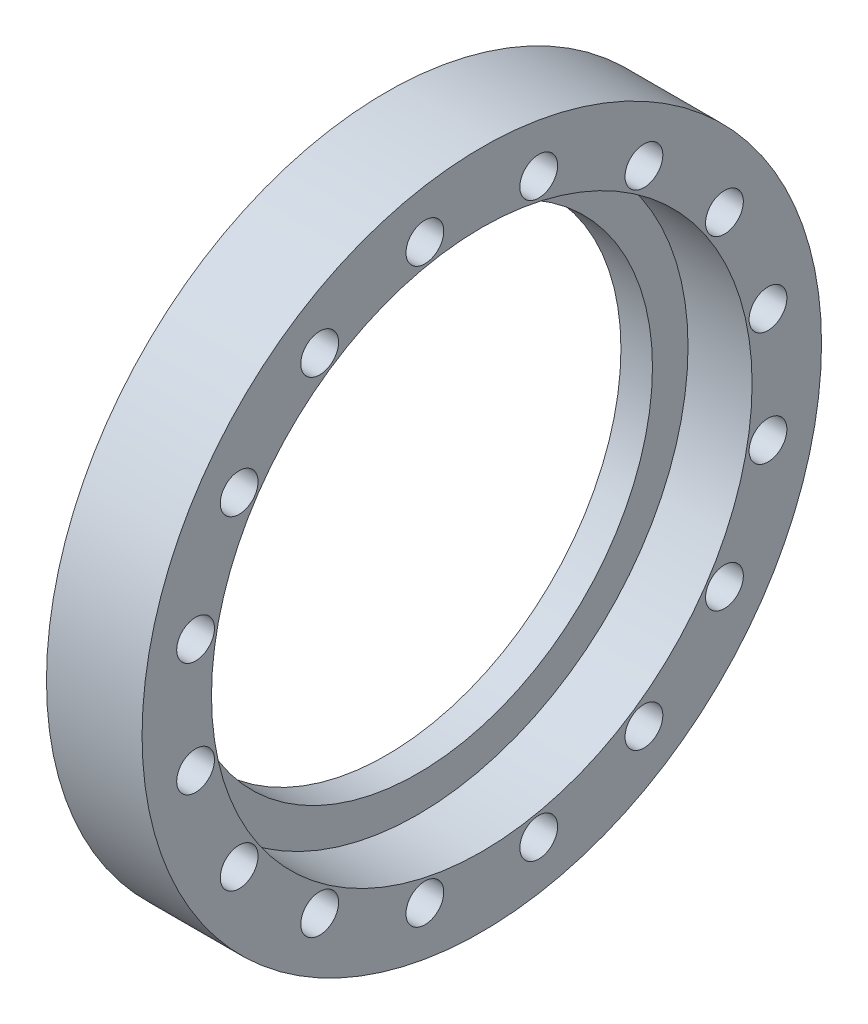
ISO-10303-21;
HEADER;
FILE_DESCRIPTION(('STEP AP214'),'2;1');
FILE_NAME('part.step','',(''),(''),'','','');
FILE_SCHEMA(('AUTOMOTIVE_DESIGN { 1 0 10303 214 1 1 1 1 }'));
ENDSEC;
DATA;
#1=APPLICATION_CONTEXT('core data for automotive mechanical design processes');
#2=APPLICATION_PROTOCOL_DEFINITION('international standard','automotive_design',2000,#1);
#3=PRODUCT_CONTEXT('',#1,'mechanical');
#4=PRODUCT('Part','Part','',(#3));
#5=PRODUCT_RELATED_PRODUCT_CATEGORY('part','',(#4));
#6=PRODUCT_DEFINITION_FORMATION('','',#4);
#7=PRODUCT_DEFINITION_CONTEXT('part definition',#1,'design');
#8=PRODUCT_DEFINITION('design','',#6,#7);
#9=PRODUCT_DEFINITION_SHAPE('','',#8);
#10=(LENGTH_UNIT() NAMED_UNIT(*) SI_UNIT(.MILLI.,.METRE.));
#11=(NAMED_UNIT(*) PLANE_ANGLE_UNIT() SI_UNIT($,.RADIAN.));
#12=(NAMED_UNIT(*) SI_UNIT($,.STERADIAN.) SOLID_ANGLE_UNIT());
#13=UNCERTAINTY_MEASURE_WITH_UNIT(LENGTH_MEASURE(1.E-05),#10,'distance_accuracy_value','');
#14=(GEOMETRIC_REPRESENTATION_CONTEXT(3) GLOBAL_UNCERTAINTY_ASSIGNED_CONTEXT((#13)) GLOBAL_UNIT_ASSIGNED_CONTEXT((#10,
#11,#12)) REPRESENTATION_CONTEXT('',''));
#15=CARTESIAN_POINT('',(0.,0.,0.));
#16=DIRECTION('',(0.,0.,1.));
#17=DIRECTION('',(1.,0.,0.));
#18=AXIS2_PLACEMENT_3D('',#15,#16,#17);
#19=CARTESIAN_POINT('',(7.03579999999964,56.35625,0.));
#20=DIRECTION('',(1.,0.,0.));
#21=DIRECTION('',(0.,0.,-1.));
#22=AXIS2_PLACEMENT_3D('',#19,#20,#21);
#23=PLANE('',#22);
#24=CARTESIAN_POINT('',(7.03579999999964,0.,0.));
#25=DIRECTION('',(1.,0.,0.));
#26=DIRECTION('',(0.,0.,-1.));
#27=AXIS2_PLACEMENT_3D('',#24,#25,#26);
#28=CIRCLE('',#27,52.3875);
#29=CARTESIAN_POINT('',(7.03579999999964,0.,-52.3875));
#30=VERTEX_POINT('',#29);
#31=EDGE_CURVE('E129',#30,#30,#28,.F.);
#32=ORIENTED_EDGE('',*,*,#31,.T.);
#33=EDGE_LOOP('',(#32));
#34=FACE_BOUND('',#33,.T.);
#35=CARTESIAN_POINT('',(7.03579999999964,0.,0.));
#36=DIRECTION('',(1.,0.,0.));
#37=DIRECTION('',(0.,0.,-1.));
#38=AXIS2_PLACEMENT_3D('',#35,#36,#37);
#39=CIRCLE('',#38,60.325);
#40=CARTESIAN_POINT('',(7.03579999999964,0.,-60.325));
#41=VERTEX_POINT('',#40);
#42=EDGE_CURVE('E17',#41,#41,#39,.T.);
#43=ORIENTED_EDGE('',*,*,#42,.T.);
#44=EDGE_LOOP('',(#43));
#45=FACE_BOUND('',#44,.T.);
#46=ADVANCED_FACE('F13',(#34,#45),#23,.T.);
#47=CARTESIAN_POINT('',(14.1858999999995,0.,0.));
#48=DIRECTION('',(1.,0.,0.));
#49=DIRECTION('',(0.,0.,-1.));
#50=AXIS2_PLACEMENT_3D('',#47,#48,#49);
#51=CYLINDRICAL_SURFACE('',#50,60.325);
#52=CARTESIAN_POINT('',(21.3359999999994,0.,0.));
#53=DIRECTION('',(1.,0.,0.));
#54=DIRECTION('',(0.,0.,-1.));
#55=AXIS2_PLACEMENT_3D('',#52,#53,#54);
#56=CIRCLE('',#55,60.325);
#57=CARTESIAN_POINT('',(21.3359999999994,0.,-60.325));
#58=VERTEX_POINT('',#57);
#59=EDGE_CURVE('E79',#58,#58,#56,.F.);
#60=ORIENTED_EDGE('',*,*,#59,.F.);
#61=EDGE_LOOP('',(#60));
#62=FACE_BOUND('',#61,.T.);
#63=ORIENTED_EDGE('',*,*,#42,.F.);
#64=EDGE_LOOP('',(#63));
#65=FACE_BOUND('',#64,.T.);
#66=ADVANCED_FACE('F137',(#62,#65),#51,.F.);
#67=CARTESIAN_POINT('',(21.3359999999994,-36.1818447675414,-54.1499573829706));
#68=DIRECTION('',(-1.,0.,0.));
#69=DIRECTION('',(0.,0.,1.));
#70=AXIS2_PLACEMENT_3D('',#67,#68,#69);
#71=CYLINDRICAL_SURFACE('',#70,4.21639999999999);
#72=CARTESIAN_POINT('',(21.3359999999994,-36.1818447675414,-54.1499573829706));
#73=DIRECTION('',(-1.,0.,0.));
#74=DIRECTION('',(0.,0.,1.));
#75=AXIS2_PLACEMENT_3D('',#72,#73,#74);
#76=CIRCLE('',#75,4.21639999999999);
#77=CARTESIAN_POINT('',(21.3359999999994,-36.1818447675414,-49.9335573829707));
#78=VERTEX_POINT('',#77);
#79=EDGE_CURVE('E127',#78,#78,#76,.T.);
#80=ORIENTED_EDGE('',*,*,#79,.F.);
#81=EDGE_LOOP('',(#80));
#82=FACE_BOUND('',#81,.T.);
#83=CARTESIAN_POINT('',(0.,-36.1818447675414,-54.1499573829706));
#84=DIRECTION('',(-1.,0.,0.));
#85=DIRECTION('',(0.,0.,1.));
#86=AXIS2_PLACEMENT_3D('',#83,#84,#85);
#87=CIRCLE('',#86,4.21639999999999);
#88=CARTESIAN_POINT('',(0.,-36.1818447675414,-49.9335573829707));
#89=VERTEX_POINT('',#88);
#90=EDGE_CURVE('E76',#89,#89,#87,.F.);
#91=ORIENTED_EDGE('',*,*,#90,.F.);
#92=EDGE_LOOP('',(#91));
#93=FACE_BOUND('',#92,.T.);
#94=ADVANCED_FACE('F139',(#82,#93),#71,.F.);
#95=CARTESIAN_POINT('',(21.3359999999994,-54.1499573829707,-36.1818447675415));
#96=DIRECTION('',(-1.,0.,0.));
#97=DIRECTION('',(0.,0.,1.));
#98=AXIS2_PLACEMENT_3D('',#95,#96,#97);
#99=CYLINDRICAL_SURFACE('',#98,4.21640000000001);
#100=CARTESIAN_POINT('',(21.3359999999994,-54.1499573829707,-36.1818447675415));
#101=DIRECTION('',(-1.,0.,0.));
#102=DIRECTION('',(0.,0.,1.));
#103=AXIS2_PLACEMENT_3D('',#100,#101,#102);
#104=CIRCLE('',#103,4.21640000000001);
#105=CARTESIAN_POINT('',(21.3359999999994,-54.1499573829707,-31.9654447675414));
#106=VERTEX_POINT('',#105);
#107=EDGE_CURVE('E124',#106,#106,#104,.T.);
#108=ORIENTED_EDGE('',*,*,#107,.F.);
#109=EDGE_LOOP('',(#108));
#110=FACE_BOUND('',#109,.T.);
#111=CARTESIAN_POINT('',(0.,-54.1499573829707,-36.1818447675415));
#112=DIRECTION('',(-1.,0.,0.));
#113=DIRECTION('',(0.,0.,1.));
#114=AXIS2_PLACEMENT_3D('',#111,#112,#113);
#115=CIRCLE('',#114,4.21640000000001);
#116=CARTESIAN_POINT('',(0.,-54.1499573829707,-31.9654447675414));
#117=VERTEX_POINT('',#116);
#118=EDGE_CURVE('E73',#117,#117,#115,.F.);
#119=ORIENTED_EDGE('',*,*,#118,.F.);
#120=EDGE_LOOP('',(#119));
#121=FACE_BOUND('',#120,.T.);
#122=ADVANCED_FACE('F147',(#110,#121),#99,.F.);
#123=CARTESIAN_POINT('',(21.3359999999994,-63.8742298574286,-12.7053742754936));
#124=DIRECTION('',(-1.,0.,0.));
#125=DIRECTION('',(0.,0.,1.));
#126=AXIS2_PLACEMENT_3D('',#123,#124,#125);
#127=CYLINDRICAL_SURFACE('',#126,4.21639999999999);
#128=CARTESIAN_POINT('',(21.3359999999994,-63.8742298574286,-12.7053742754936));
#129=DIRECTION('',(-1.,0.,0.));
#130=DIRECTION('',(0.,0.,1.));
#131=AXIS2_PLACEMENT_3D('',#128,#129,#130);
#132=CIRCLE('',#131,4.21639999999999);
#133=CARTESIAN_POINT('',(21.3359999999994,-63.8742298574286,-8.48897427549359));
#134=VERTEX_POINT('',#133);
#135=EDGE_CURVE('E121',#134,#134,#132,.T.);
#136=ORIENTED_EDGE('',*,*,#135,.F.);
#137=EDGE_LOOP('',(#136));
#138=FACE_BOUND('',#137,.T.);
#139=CARTESIAN_POINT('',(0.,-63.8742298574286,-12.7053742754936));
#140=DIRECTION('',(-1.,0.,0.));
#141=DIRECTION('',(0.,0.,1.));
#142=AXIS2_PLACEMENT_3D('',#139,#140,#141);
#143=CIRCLE('',#142,4.21639999999999);
#144=CARTESIAN_POINT('',(0.,-63.8742298574286,-8.48897427549359));
#145=VERTEX_POINT('',#144);
#146=EDGE_CURVE('E70',#145,#145,#143,.F.);
#147=ORIENTED_EDGE('',*,*,#146,.F.);
#148=EDGE_LOOP('',(#147));
#149=FACE_BOUND('',#148,.T.);
#150=ADVANCED_FACE('F213',(#138,#149),#127,.F.);
#151=CARTESIAN_POINT('',(21.3359999999994,-63.8742298574286,12.7053742754936));
#152=DIRECTION('',(-1.,0.,0.));
#153=DIRECTION('',(0.,0.,1.));
#154=AXIS2_PLACEMENT_3D('',#151,#152,#153);
#155=CYLINDRICAL_SURFACE('',#154,4.2164);
#156=CARTESIAN_POINT('',(21.3359999999994,-63.8742298574286,12.7053742754936));
#157=DIRECTION('',(-1.,0.,0.));
#158=DIRECTION('',(0.,0.,1.));
#159=AXIS2_PLACEMENT_3D('',#156,#157,#158);
#160=CIRCLE('',#159,4.2164);
#161=CARTESIAN_POINT('',(21.3359999999994,-63.8742298574286,16.9217742754936));
#162=VERTEX_POINT('',#161);
#163=EDGE_CURVE('E118',#162,#162,#160,.T.);
#164=ORIENTED_EDGE('',*,*,#163,.F.);
#165=EDGE_LOOP('',(#164));
#166=FACE_BOUND('',#165,.T.);
#167=CARTESIAN_POINT('',(0.,-63.8742298574286,12.7053742754936));
#168=DIRECTION('',(-1.,0.,0.));
#169=DIRECTION('',(0.,0.,1.));
#170=AXIS2_PLACEMENT_3D('',#167,#168,#169);
#171=CIRCLE('',#170,4.2164);
#172=CARTESIAN_POINT('',(0.,-63.8742298574286,16.9217742754936));
#173=VERTEX_POINT('',#172);
#174=EDGE_CURVE('E67',#173,#173,#171,.F.);
#175=ORIENTED_EDGE('',*,*,#174,.F.);
#176=EDGE_LOOP('',(#175));
#177=FACE_BOUND('',#176,.T.);
#178=ADVANCED_FACE('F219',(#166,#177),#155,.F.);
#179=CARTESIAN_POINT('',(21.3359999999994,-54.1499573829707,36.1818447675414));
#180=DIRECTION('',(-1.,0.,0.));
#181=DIRECTION('',(0.,0.,1.));
#182=AXIS2_PLACEMENT_3D('',#179,#180,#181);
#183=CYLINDRICAL_SURFACE('',#182,4.2164);
#184=CARTESIAN_POINT('',(21.3359999999994,-54.1499573829707,36.1818447675414));
#185=DIRECTION('',(-1.,0.,0.));
#186=DIRECTION('',(0.,0.,1.));
#187=AXIS2_PLACEMENT_3D('',#184,#185,#186);
#188=CIRCLE('',#187,4.2164);
#189=CARTESIAN_POINT('',(21.3359999999994,-54.1499573829707,40.3982447675414));
#190=VERTEX_POINT('',#189);
#191=EDGE_CURVE('E115',#190,#190,#188,.T.);
#192=ORIENTED_EDGE('',*,*,#191,.F.);
#193=EDGE_LOOP('',(#192));
#194=FACE_BOUND('',#193,.T.);
#195=CARTESIAN_POINT('',(0.,-54.1499573829707,36.1818447675414));
#196=DIRECTION('',(-1.,0.,0.));
#197=DIRECTION('',(0.,0.,1.));
#198=AXIS2_PLACEMENT_3D('',#195,#196,#197);
#199=CIRCLE('',#198,4.2164);
#200=CARTESIAN_POINT('',(0.,-54.1499573829707,40.3982447675414));
#201=VERTEX_POINT('',#200);
#202=EDGE_CURVE('E64',#201,#201,#199,.F.);
#203=ORIENTED_EDGE('',*,*,#202,.F.);
#204=EDGE_LOOP('',(#203));
#205=FACE_BOUND('',#204,.T.);
#206=ADVANCED_FACE('F226',(#194,#205),#183,.F.);
#207=CARTESIAN_POINT('',(21.3359999999994,-36.1818447675414,54.1499573829706));
#208=DIRECTION('',(-1.,0.,0.));
#209=DIRECTION('',(0.,0.,1.));
#210=AXIS2_PLACEMENT_3D('',#207,#208,#209);
#211=CYLINDRICAL_SURFACE('',#210,4.21640000000001);
#212=CARTESIAN_POINT('',(21.3359999999994,-36.1818447675414,54.1499573829706));
#213=DIRECTION('',(-1.,0.,0.));
#214=DIRECTION('',(0.,0.,1.));
#215=AXIS2_PLACEMENT_3D('',#212,#213,#214);
#216=CIRCLE('',#215,4.21640000000001);
#217=CARTESIAN_POINT('',(21.3359999999994,-36.1818447675414,58.3663573829707));
#218=VERTEX_POINT('',#217);
#219=EDGE_CURVE('E112',#218,#218,#216,.T.);
#220=ORIENTED_EDGE('',*,*,#219,.F.);
#221=EDGE_LOOP('',(#220));
#222=FACE_BOUND('',#221,.T.);
#223=CARTESIAN_POINT('',(0.,-36.1818447675414,54.1499573829706));
#224=DIRECTION('',(-1.,0.,0.));
#225=DIRECTION('',(0.,0.,1.));
#226=AXIS2_PLACEMENT_3D('',#223,#224,#225);
#227=CIRCLE('',#226,4.21640000000001);
#228=CARTESIAN_POINT('',(0.,-36.1818447675414,58.3663573829707));
#229=VERTEX_POINT('',#228);
#230=EDGE_CURVE('E61',#229,#229,#227,.F.);
#231=ORIENTED_EDGE('',*,*,#230,.F.);
#232=EDGE_LOOP('',(#231));
#233=FACE_BOUND('',#232,.T.);
#234=ADVANCED_FACE('F230',(#222,#233),#211,.F.);
#235=CARTESIAN_POINT('',(21.3359999999994,-12.7053742754936,63.8742298574286));
#236=DIRECTION('',(-1.,0.,0.));
#237=DIRECTION('',(0.,0.,1.));
#238=AXIS2_PLACEMENT_3D('',#235,#236,#237);
#239=CYLINDRICAL_SURFACE('',#238,4.21639999999999);
#240=CARTESIAN_POINT('',(21.3359999999994,-12.7053742754936,63.8742298574286));
#241=DIRECTION('',(-1.,0.,0.));
#242=DIRECTION('',(0.,0.,1.));
#243=AXIS2_PLACEMENT_3D('',#240,#241,#242);
#244=CIRCLE('',#243,4.21639999999999);
#245=CARTESIAN_POINT('',(21.3359999999994,-12.7053742754936,68.0906298574286));
#246=VERTEX_POINT('',#245);
#247=EDGE_CURVE('E109',#246,#246,#244,.T.);
#248=ORIENTED_EDGE('',*,*,#247,.F.);
#249=EDGE_LOOP('',(#248));
#250=FACE_BOUND('',#249,.T.);
#251=CARTESIAN_POINT('',(0.,-12.7053742754936,63.8742298574286));
#252=DIRECTION('',(-1.,0.,0.));
#253=DIRECTION('',(0.,0.,1.));
#254=AXIS2_PLACEMENT_3D('',#251,#252,#253);
#255=CIRCLE('',#254,4.21639999999999);
#256=CARTESIAN_POINT('',(0.,-12.7053742754936,68.0906298574286));
#257=VERTEX_POINT('',#256);
#258=EDGE_CURVE('E58',#257,#257,#255,.F.);
#259=ORIENTED_EDGE('',*,*,#258,.F.);
#260=EDGE_LOOP('',(#259));
#261=FACE_BOUND('',#260,.T.);
#262=ADVANCED_FACE('F234',(#250,#261),#239,.F.);
#263=CARTESIAN_POINT('',(21.3359999999994,12.7053742754935,63.8742298574287));
#264=DIRECTION('',(-1.,0.,0.));
#265=DIRECTION('',(0.,0.,1.));
#266=AXIS2_PLACEMENT_3D('',#263,#264,#265);
#267=CYLINDRICAL_SURFACE('',#266,4.21640000000001);
#268=CARTESIAN_POINT('',(21.3359999999994,12.7053742754935,63.8742298574287));
#269=DIRECTION('',(-1.,0.,0.));
#270=DIRECTION('',(0.,0.,1.));
#271=AXIS2_PLACEMENT_3D('',#268,#269,#270);
#272=CIRCLE('',#271,4.21640000000001);
#273=CARTESIAN_POINT('',(21.3359999999994,12.7053742754935,68.0906298574287));
#274=VERTEX_POINT('',#273);
#275=EDGE_CURVE('E106',#274,#274,#272,.T.);
#276=ORIENTED_EDGE('',*,*,#275,.F.);
#277=EDGE_LOOP('',(#276));
#278=FACE_BOUND('',#277,.T.);
#279=CARTESIAN_POINT('',(0.,12.7053742754935,63.8742298574287));
#280=DIRECTION('',(-1.,0.,0.));
#281=DIRECTION('',(0.,0.,1.));
#282=AXIS2_PLACEMENT_3D('',#279,#280,#281);
#283=CIRCLE('',#282,4.21640000000001);
#284=CARTESIAN_POINT('',(0.,12.7053742754935,68.0906298574287));
#285=VERTEX_POINT('',#284);
#286=EDGE_CURVE('E55',#285,#285,#283,.F.);
#287=ORIENTED_EDGE('',*,*,#286,.F.);
#288=EDGE_LOOP('',(#287));
#289=FACE_BOUND('',#288,.T.);
#290=ADVANCED_FACE('F238',(#278,#289),#267,.F.);
#291=CARTESIAN_POINT('',(21.3359999999994,36.1818447675414,54.1499573829707));
#292=DIRECTION('',(-1.,0.,0.));
#293=DIRECTION('',(0.,0.,1.));
#294=AXIS2_PLACEMENT_3D('',#291,#292,#293);
#295=CYLINDRICAL_SURFACE('',#294,4.2164);
#296=CARTESIAN_POINT('',(21.3359999999994,36.1818447675414,54.1499573829707));
#297=DIRECTION('',(-1.,0.,0.));
#298=DIRECTION('',(0.,0.,1.));
#299=AXIS2_PLACEMENT_3D('',#296,#297,#298);
#300=CIRCLE('',#299,4.2164);
#301=CARTESIAN_POINT('',(21.3359999999994,36.1818447675414,58.3663573829707));
#302=VERTEX_POINT('',#301);
#303=EDGE_CURVE('E103',#302,#302,#300,.T.);
#304=ORIENTED_EDGE('',*,*,#303,.F.);
#305=EDGE_LOOP('',(#304));
#306=FACE_BOUND('',#305,.T.);
#307=CARTESIAN_POINT('',(0.,36.1818447675414,54.1499573829707));
#308=DIRECTION('',(-1.,0.,0.));
#309=DIRECTION('',(0.,0.,1.));
#310=AXIS2_PLACEMENT_3D('',#307,#308,#309);
#311=CIRCLE('',#310,4.2164);
#312=CARTESIAN_POINT('',(0.,36.1818447675414,58.3663573829707));
#313=VERTEX_POINT('',#312);
#314=EDGE_CURVE('E52',#313,#313,#311,.F.);
#315=ORIENTED_EDGE('',*,*,#314,.F.);
#316=EDGE_LOOP('',(#315));
#317=FACE_BOUND('',#316,.T.);
#318=ADVANCED_FACE('F242',(#306,#317),#295,.F.);
#319=CARTESIAN_POINT('',(21.3359999999994,54.1499573829707,36.1818447675415));
#320=DIRECTION('',(-1.,0.,0.));
#321=DIRECTION('',(0.,0.,1.));
#322=AXIS2_PLACEMENT_3D('',#319,#320,#321);
#323=CYLINDRICAL_SURFACE('',#322,4.21640000000001);
#324=CARTESIAN_POINT('',(21.3359999999994,54.1499573829707,36.1818447675415));
#325=DIRECTION('',(-1.,0.,0.));
#326=DIRECTION('',(0.,0.,1.));
#327=AXIS2_PLACEMENT_3D('',#324,#325,#326);
#328=CIRCLE('',#327,4.21640000000001);
#329=CARTESIAN_POINT('',(21.3359999999994,54.1499573829707,40.3982447675415));
#330=VERTEX_POINT('',#329);
#331=EDGE_CURVE('E100',#330,#330,#328,.T.);
#332=ORIENTED_EDGE('',*,*,#331,.F.);
#333=EDGE_LOOP('',(#332));
#334=FACE_BOUND('',#333,.T.);
#335=CARTESIAN_POINT('',(0.,54.1499573829707,36.1818447675415));
#336=DIRECTION('',(-1.,0.,0.));
#337=DIRECTION('',(0.,0.,1.));
#338=AXIS2_PLACEMENT_3D('',#335,#336,#337);
#339=CIRCLE('',#338,4.21640000000001);
#340=CARTESIAN_POINT('',(0.,54.1499573829707,40.3982447675415));
#341=VERTEX_POINT('',#340);
#342=EDGE_CURVE('E49',#341,#341,#339,.F.);
#343=ORIENTED_EDGE('',*,*,#342,.F.);
#344=EDGE_LOOP('',(#343));
#345=FACE_BOUND('',#344,.T.);
#346=ADVANCED_FACE('F246',(#334,#345),#323,.F.);
#347=CARTESIAN_POINT('',(21.3359999999994,63.8742298574286,12.7053742754936));
#348=DIRECTION('',(-1.,0.,0.));
#349=DIRECTION('',(0.,0.,1.));
#350=AXIS2_PLACEMENT_3D('',#347,#348,#349);
#351=CYLINDRICAL_SURFACE('',#350,4.21639999999999);
#352=CARTESIAN_POINT('',(21.3359999999994,63.8742298574286,12.7053742754936));
#353=DIRECTION('',(-1.,0.,0.));
#354=DIRECTION('',(0.,0.,1.));
#355=AXIS2_PLACEMENT_3D('',#352,#353,#354);
#356=CIRCLE('',#355,4.21639999999999);
#357=CARTESIAN_POINT('',(21.3359999999994,63.8742298574286,16.9217742754936));
#358=VERTEX_POINT('',#357);
#359=EDGE_CURVE('E97',#358,#358,#356,.T.);
#360=ORIENTED_EDGE('',*,*,#359,.F.);
#361=EDGE_LOOP('',(#360));
#362=FACE_BOUND('',#361,.T.);
#363=CARTESIAN_POINT('',(0.,63.8742298574286,12.7053742754936));
#364=DIRECTION('',(-1.,0.,0.));
#365=DIRECTION('',(0.,0.,1.));
#366=AXIS2_PLACEMENT_3D('',#363,#364,#365);
#367=CIRCLE('',#366,4.21639999999999);
#368=CARTESIAN_POINT('',(0.,63.8742298574286,16.9217742754936));
#369=VERTEX_POINT('',#368);
#370=EDGE_CURVE('E46',#369,#369,#367,.F.);
#371=ORIENTED_EDGE('',*,*,#370,.F.);
#372=EDGE_LOOP('',(#371));
#373=FACE_BOUND('',#372,.T.);
#374=ADVANCED_FACE('F250',(#362,#373),#351,.F.);
#375=CARTESIAN_POINT('',(21.3359999999994,63.8742298574287,-12.7053742754935));
#376=DIRECTION('',(-1.,0.,0.));
#377=DIRECTION('',(0.,0.,1.));
#378=AXIS2_PLACEMENT_3D('',#375,#376,#377);
#379=CYLINDRICAL_SURFACE('',#378,4.21640000000001);
#380=CARTESIAN_POINT('',(21.3359999999994,63.8742298574287,-12.7053742754935));
#381=DIRECTION('',(-1.,0.,0.));
#382=DIRECTION('',(0.,0.,1.));
#383=AXIS2_PLACEMENT_3D('',#380,#381,#382);
#384=CIRCLE('',#383,4.21640000000001);
#385=CARTESIAN_POINT('',(21.3359999999994,63.8742298574287,-8.48897427549354));
#386=VERTEX_POINT('',#385);
#387=EDGE_CURVE('E94',#386,#386,#384,.T.);
#388=ORIENTED_EDGE('',*,*,#387,.F.);
#389=EDGE_LOOP('',(#388));
#390=FACE_BOUND('',#389,.T.);
#391=CARTESIAN_POINT('',(0.,63.8742298574287,-12.7053742754935));
#392=DIRECTION('',(-1.,0.,0.));
#393=DIRECTION('',(0.,0.,1.));
#394=AXIS2_PLACEMENT_3D('',#391,#392,#393);
#395=CIRCLE('',#394,4.21640000000001);
#396=CARTESIAN_POINT('',(0.,63.8742298574287,-8.48897427549354));
#397=VERTEX_POINT('',#396);
#398=EDGE_CURVE('E43',#397,#397,#395,.F.);
#399=ORIENTED_EDGE('',*,*,#398,.F.);
#400=EDGE_LOOP('',(#399));
#401=FACE_BOUND('',#400,.T.);
#402=ADVANCED_FACE('F254',(#390,#401),#379,.F.);
#403=CARTESIAN_POINT('',(21.3359999999994,54.1499573829707,-36.1818447675414));
#404=DIRECTION('',(-1.,0.,0.));
#405=DIRECTION('',(0.,0.,1.));
#406=AXIS2_PLACEMENT_3D('',#403,#404,#405);
#407=CYLINDRICAL_SURFACE('',#406,4.2164);
#408=CARTESIAN_POINT('',(21.3359999999994,54.1499573829707,-36.1818447675414));
#409=DIRECTION('',(-1.,0.,0.));
#410=DIRECTION('',(0.,0.,1.));
#411=AXIS2_PLACEMENT_3D('',#408,#409,#410);
#412=CIRCLE('',#411,4.2164);
#413=CARTESIAN_POINT('',(21.3359999999994,54.1499573829707,-31.9654447675414));
#414=VERTEX_POINT('',#413);
#415=EDGE_CURVE('E91',#414,#414,#412,.T.);
#416=ORIENTED_EDGE('',*,*,#415,.F.);
#417=EDGE_LOOP('',(#416));
#418=FACE_BOUND('',#417,.T.);
#419=CARTESIAN_POINT('',(0.,54.1499573829707,-36.1818447675414));
#420=DIRECTION('',(-1.,0.,0.));
#421=DIRECTION('',(0.,0.,1.));
#422=AXIS2_PLACEMENT_3D('',#419,#420,#421);
#423=CIRCLE('',#422,4.2164);
#424=CARTESIAN_POINT('',(0.,54.1499573829707,-31.9654447675414));
#425=VERTEX_POINT('',#424);
#426=EDGE_CURVE('E40',#425,#425,#423,.F.);
#427=ORIENTED_EDGE('',*,*,#426,.F.);
#428=EDGE_LOOP('',(#427));
#429=FACE_BOUND('',#428,.T.);
#430=ADVANCED_FACE('F258',(#418,#429),#407,.F.);
#431=CARTESIAN_POINT('',(21.3359999999994,36.1818447675414,-54.1499573829706));
#432=DIRECTION('',(-1.,0.,0.));
#433=DIRECTION('',(0.,0.,1.));
#434=AXIS2_PLACEMENT_3D('',#431,#432,#433);
#435=CYLINDRICAL_SURFACE('',#434,4.21639999999998);
#436=CARTESIAN_POINT('',(21.3359999999994,36.1818447675414,-54.1499573829706));
#437=DIRECTION('',(-1.,0.,0.));
#438=DIRECTION('',(0.,0.,1.));
#439=AXIS2_PLACEMENT_3D('',#436,#437,#438);
#440=CIRCLE('',#439,4.21639999999998);
#441=CARTESIAN_POINT('',(21.3359999999994,36.1818447675414,-49.9335573829706));
#442=VERTEX_POINT('',#441);
#443=EDGE_CURVE('E88',#442,#442,#440,.T.);
#444=ORIENTED_EDGE('',*,*,#443,.F.);
#445=EDGE_LOOP('',(#444));
#446=FACE_BOUND('',#445,.T.);
#447=CARTESIAN_POINT('',(0.,36.1818447675414,-54.1499573829706));
#448=DIRECTION('',(-1.,0.,0.));
#449=DIRECTION('',(0.,0.,1.));
#450=AXIS2_PLACEMENT_3D('',#447,#448,#449);
#451=CIRCLE('',#450,4.21639999999998);
#452=CARTESIAN_POINT('',(0.,36.1818447675414,-49.9335573829706));
#453=VERTEX_POINT('',#452);
#454=EDGE_CURVE('E37',#453,#453,#451,.F.);
#455=ORIENTED_EDGE('',*,*,#454,.F.);
#456=EDGE_LOOP('',(#455));
#457=FACE_BOUND('',#456,.T.);
#458=ADVANCED_FACE('F262',(#446,#457),#435,.F.);
#459=CARTESIAN_POINT('',(21.3359999999994,-12.7053742754936,-63.8742298574286));
#460=DIRECTION('',(-1.,0.,0.));
#461=DIRECTION('',(0.,0.,1.));
#462=AXIS2_PLACEMENT_3D('',#459,#460,#461);
#463=CYLINDRICAL_SURFACE('',#462,4.2164);
#464=CARTESIAN_POINT('',(21.3359999999994,-12.7053742754936,-63.8742298574286));
#465=DIRECTION('',(-1.,0.,0.));
#466=DIRECTION('',(0.,0.,1.));
#467=AXIS2_PLACEMENT_3D('',#464,#465,#466);
#468=CIRCLE('',#467,4.2164);
#469=CARTESIAN_POINT('',(21.3359999999994,-12.7053742754936,-59.6578298574286));
#470=VERTEX_POINT('',#469);
#471=EDGE_CURVE('E85',#470,#470,#468,.T.);
#472=ORIENTED_EDGE('',*,*,#471,.F.);
#473=EDGE_LOOP('',(#472));
#474=FACE_BOUND('',#473,.T.);
#475=CARTESIAN_POINT('',(0.,-12.7053742754936,-63.8742298574286));
#476=DIRECTION('',(-1.,0.,0.));
#477=DIRECTION('',(0.,0.,1.));
#478=AXIS2_PLACEMENT_3D('',#475,#476,#477);
#479=CIRCLE('',#478,4.2164);
#480=CARTESIAN_POINT('',(0.,-12.7053742754936,-59.6578298574286));
#481=VERTEX_POINT('',#480);
#482=EDGE_CURVE('E34',#481,#481,#479,.F.);
#483=ORIENTED_EDGE('',*,*,#482,.F.);
#484=EDGE_LOOP('',(#483));
#485=FACE_BOUND('',#484,.T.);
#486=ADVANCED_FACE('F173',(#474,#485),#463,.F.);
#487=CARTESIAN_POINT('',(21.3359999999994,12.7053742754936,-63.8742298574286));
#488=DIRECTION('',(-1.,0.,0.));
#489=DIRECTION('',(0.,0.,1.));
#490=AXIS2_PLACEMENT_3D('',#487,#488,#489);
#491=CYLINDRICAL_SURFACE('',#490,4.21639999999999);
#492=CARTESIAN_POINT('',(21.3359999999994,12.7053742754936,-63.8742298574286));
#493=DIRECTION('',(-1.,0.,0.));
#494=DIRECTION('',(0.,0.,1.));
#495=AXIS2_PLACEMENT_3D('',#492,#493,#494);
#496=CIRCLE('',#495,4.21639999999999);
#497=CARTESIAN_POINT('',(21.3359999999994,12.7053742754936,-59.6578298574286));
#498=VERTEX_POINT('',#497);
#499=EDGE_CURVE('E82',#498,#498,#496,.T.);
#500=ORIENTED_EDGE('',*,*,#499,.F.);
#501=EDGE_LOOP('',(#500));
#502=FACE_BOUND('',#501,.T.);
#503=CARTESIAN_POINT('',(0.,12.7053742754936,-63.8742298574286));
#504=DIRECTION('',(-1.,0.,0.));
#505=DIRECTION('',(0.,0.,1.));
#506=AXIS2_PLACEMENT_3D('',#503,#504,#505);
#507=CIRCLE('',#506,4.21639999999999);
#508=CARTESIAN_POINT('',(0.,12.7053742754936,-59.6578298574286));
#509=VERTEX_POINT('',#508);
#510=EDGE_CURVE('E31',#509,#509,#507,.F.);
#511=ORIENTED_EDGE('',*,*,#510,.F.);
#512=EDGE_LOOP('',(#511));
#513=FACE_BOUND('',#512,.T.);
#514=ADVANCED_FACE('F15',(#502,#513),#491,.F.);
#515=CARTESIAN_POINT('',(3.51789999999982,0.,0.));
#516=DIRECTION('',(1.,0.,0.));
#517=DIRECTION('',(0.,0.,-1.));
#518=AXIS2_PLACEMENT_3D('',#515,#516,#517);
#519=CYLINDRICAL_SURFACE('',#518,52.3875);
#520=ORIENTED_EDGE('',*,*,#31,.F.);
#521=EDGE_LOOP('',(#520));
#522=FACE_BOUND('',#521,.T.);
#523=CARTESIAN_POINT('',(0.,0.,0.));
#524=DIRECTION('',(1.,0.,0.));
#525=DIRECTION('',(0.,0.,-1.));
#526=AXIS2_PLACEMENT_3D('',#523,#524,#525);
#527=CIRCLE('',#526,52.3875);
#528=CARTESIAN_POINT('',(0.,0.,-52.3875));
#529=VERTEX_POINT('',#528);
#530=EDGE_CURVE('E26',#529,#529,#527,.T.);
#531=ORIENTED_EDGE('',*,*,#530,.F.);
#532=EDGE_LOOP('',(#531));
#533=FACE_BOUND('',#532,.T.);
#534=ADVANCED_FACE('F166',(#522,#533),#519,.F.);
#535=CARTESIAN_POINT('',(21.3359999999994,68.0720000000002,0.));
#536=DIRECTION('',(1.,0.,0.));
#537=DIRECTION('',(0.,0.,-1.));
#538=AXIS2_PLACEMENT_3D('',#535,#536,#537);
#539=PLANE('',#538);
#540=ORIENTED_EDGE('',*,*,#59,.T.);
#541=EDGE_LOOP('',(#540));
#542=FACE_BOUND('',#541,.T.);
#543=ORIENTED_EDGE('',*,*,#499,.T.);
#544=EDGE_LOOP('',(#543));
#545=FACE_BOUND('',#544,.T.);
#546=ORIENTED_EDGE('',*,*,#471,.T.);
#547=EDGE_LOOP('',(#546));
#548=FACE_BOUND('',#547,.T.);
#549=ORIENTED_EDGE('',*,*,#443,.T.);
#550=EDGE_LOOP('',(#549));
#551=FACE_BOUND('',#550,.T.);
#552=ORIENTED_EDGE('',*,*,#415,.T.);
#553=EDGE_LOOP('',(#552));
#554=FACE_BOUND('',#553,.T.);
#555=ORIENTED_EDGE('',*,*,#387,.T.);
#556=EDGE_LOOP('',(#555));
#557=FACE_BOUND('',#556,.T.);
#558=ORIENTED_EDGE('',*,*,#359,.T.);
#559=EDGE_LOOP('',(#558));
#560=FACE_BOUND('',#559,.T.);
#561=ORIENTED_EDGE('',*,*,#331,.T.);
#562=EDGE_LOOP('',(#561));
#563=FACE_BOUND('',#562,.T.);
#564=ORIENTED_EDGE('',*,*,#303,.T.);
#565=EDGE_LOOP('',(#564));
#566=FACE_BOUND('',#565,.T.);
#567=ORIENTED_EDGE('',*,*,#275,.T.);
#568=EDGE_LOOP('',(#567));
#569=FACE_BOUND('',#568,.T.);
#570=ORIENTED_EDGE('',*,*,#247,.T.);
#571=EDGE_LOOP('',(#570));
#572=FACE_BOUND('',#571,.T.);
#573=ORIENTED_EDGE('',*,*,#219,.T.);
#574=EDGE_LOOP('',(#573));
#575=FACE_BOUND('',#574,.T.);
#576=ORIENTED_EDGE('',*,*,#191,.T.);
#577=EDGE_LOOP('',(#576));
#578=FACE_BOUND('',#577,.T.);
#579=ORIENTED_EDGE('',*,*,#163,.T.);
#580=EDGE_LOOP('',(#579));
#581=FACE_BOUND('',#580,.T.);
#582=ORIENTED_EDGE('',*,*,#135,.T.);
#583=EDGE_LOOP('',(#582));
#584=FACE_BOUND('',#583,.T.);
#585=ORIENTED_EDGE('',*,*,#107,.T.);
#586=EDGE_LOOP('',(#585));
#587=FACE_BOUND('',#586,.T.);
#588=ORIENTED_EDGE('',*,*,#79,.T.);
#589=EDGE_LOOP('',(#588));
#590=FACE_BOUND('',#589,.T.);
#591=CARTESIAN_POINT('',(21.3359999999994,0.,0.));
#592=DIRECTION('',(1.,0.,0.));
#593=DIRECTION('',(0.,0.,-1.));
#594=AXIS2_PLACEMENT_3D('',#591,#592,#593);
#595=CIRCLE('',#594,75.8190000000003);
#596=CARTESIAN_POINT('',(21.3359999999994,0.,-75.8190000000003));
#597=VERTEX_POINT('',#596);
#598=EDGE_CURVE('E21',#597,#597,#595,.F.);
#599=ORIENTED_EDGE('',*,*,#598,.F.);
#600=EDGE_LOOP('',(#599));
#601=FACE_BOUND('',#600,.T.);
#602=ADVANCED_FACE('F160',(#542,#545,#548,#551,#554,#557,#560,#563,#566,#569,#572,#575,#578,
#581,#584,#587,#590,#601),#539,.T.);
#603=CARTESIAN_POINT('',(0.,64.1032500000002,0.));
#604=DIRECTION('',(-1.,0.,0.));
#605=DIRECTION('',(0.,0.,1.));
#606=AXIS2_PLACEMENT_3D('',#603,#604,#605);
#607=PLANE('',#606);
#608=ORIENTED_EDGE('',*,*,#530,.T.);
#609=EDGE_LOOP('',(#608));
#610=FACE_BOUND('',#609,.T.);
#611=ORIENTED_EDGE('',*,*,#510,.T.);
#612=EDGE_LOOP('',(#611));
#613=FACE_BOUND('',#612,.T.);
#614=ORIENTED_EDGE('',*,*,#482,.T.);
#615=EDGE_LOOP('',(#614));
#616=FACE_BOUND('',#615,.T.);
#617=ORIENTED_EDGE('',*,*,#454,.T.);
#618=EDGE_LOOP('',(#617));
#619=FACE_BOUND('',#618,.T.);
#620=ORIENTED_EDGE('',*,*,#426,.T.);
#621=EDGE_LOOP('',(#620));
#622=FACE_BOUND('',#621,.T.);
#623=ORIENTED_EDGE('',*,*,#398,.T.);
#624=EDGE_LOOP('',(#623));
#625=FACE_BOUND('',#624,.T.);
#626=ORIENTED_EDGE('',*,*,#370,.T.);
#627=EDGE_LOOP('',(#626));
#628=FACE_BOUND('',#627,.T.);
#629=ORIENTED_EDGE('',*,*,#342,.T.);
#630=EDGE_LOOP('',(#629));
#631=FACE_BOUND('',#630,.T.);
#632=ORIENTED_EDGE('',*,*,#314,.T.);
#633=EDGE_LOOP('',(#632));
#634=FACE_BOUND('',#633,.T.);
#635=ORIENTED_EDGE('',*,*,#286,.T.);
#636=EDGE_LOOP('',(#635));
#637=FACE_BOUND('',#636,.T.);
#638=ORIENTED_EDGE('',*,*,#258,.T.);
#639=EDGE_LOOP('',(#638));
#640=FACE_BOUND('',#639,.T.);
#641=ORIENTED_EDGE('',*,*,#230,.T.);
#642=EDGE_LOOP('',(#641));
#643=FACE_BOUND('',#642,.T.);
#644=ORIENTED_EDGE('',*,*,#202,.T.);
#645=EDGE_LOOP('',(#644));
#646=FACE_BOUND('',#645,.T.);
#647=ORIENTED_EDGE('',*,*,#174,.T.);
#648=EDGE_LOOP('',(#647));
#649=FACE_BOUND('',#648,.T.);
#650=ORIENTED_EDGE('',*,*,#146,.T.);
#651=EDGE_LOOP('',(#650));
#652=FACE_BOUND('',#651,.T.);
#653=ORIENTED_EDGE('',*,*,#118,.T.);
#654=EDGE_LOOP('',(#653));
#655=FACE_BOUND('',#654,.T.);
#656=ORIENTED_EDGE('',*,*,#90,.T.);
#657=EDGE_LOOP('',(#656));
#658=FACE_BOUND('',#657,.T.);
#659=CARTESIAN_POINT('',(0.,0.,0.));
#660=DIRECTION('',(1.,0.,0.));
#661=DIRECTION('',(0.,0.,-1.));
#662=AXIS2_PLACEMENT_3D('',#659,#660,#661);
#663=CIRCLE('',#662,75.8190000000003);
#664=CARTESIAN_POINT('',(0.,0.,-75.8190000000003));
#665=VERTEX_POINT('',#664);
#666=EDGE_CURVE('E9',#665,#665,#663,.T.);
#667=ORIENTED_EDGE('',*,*,#666,.F.);
#668=EDGE_LOOP('',(#667));
#669=FACE_BOUND('',#668,.T.);
#670=ADVANCED_FACE('F155',(#610,#613,#616,#619,#622,#625,#628,#631,#634,#637,#640,#643,#646,
#649,#652,#655,#658,#669),#607,.T.);
#671=CARTESIAN_POINT('',(10.6679999999997,0.,0.));
#672=DIRECTION('',(1.,0.,0.));
#673=DIRECTION('',(0.,0.,-1.));
#674=AXIS2_PLACEMENT_3D('',#671,#672,#673);
#675=CYLINDRICAL_SURFACE('',#674,75.8190000000003);
#676=ORIENTED_EDGE('',*,*,#666,.T.);
#677=EDGE_LOOP('',(#676));
#678=FACE_BOUND('',#677,.T.);
#679=ORIENTED_EDGE('',*,*,#598,.T.);
#680=EDGE_LOOP('',(#679));
#681=FACE_BOUND('',#680,.T.);
#682=ADVANCED_FACE('F153',(#678,#681),#675,.T.);
#683=CLOSED_SHELL('',(#46,#66,#94,#122,#150,#178,#206,#234,#262,#290,#318,#346,#374,#402,#430,
#458,#486,#514,#534,#602,#670,#682));
#684=MANIFOLD_SOLID_BREP('B1',#683);
#685=ADVANCED_BREP_SHAPE_REPRESENTATION('',(#18,#684),#14);
#686=SHAPE_DEFINITION_REPRESENTATION(#9,#685);
ENDSEC;
END-ISO-10303-21;
